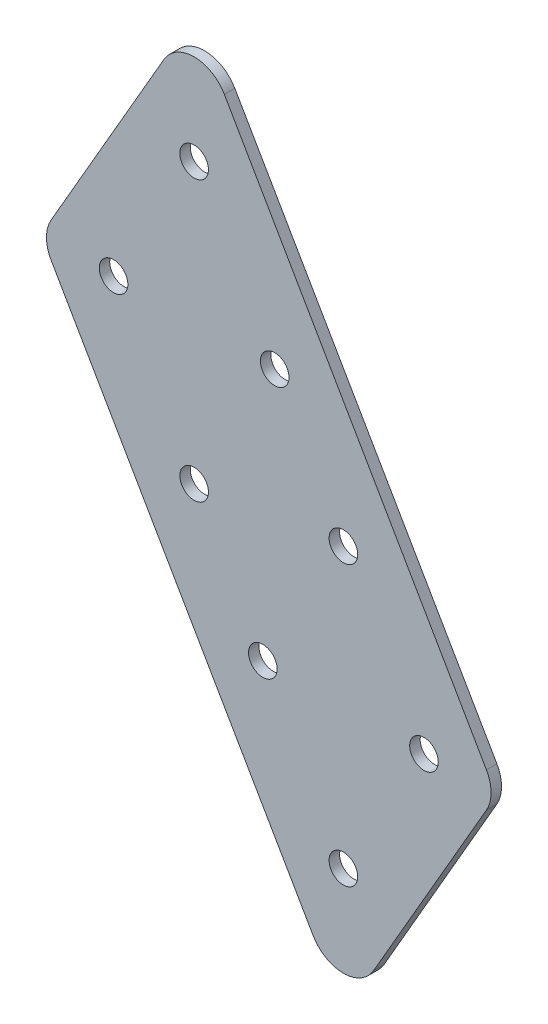
ISO-10303-21;
HEADER;
FILE_DESCRIPTION(('STEP AP214'),'2;1');
FILE_NAME('part.step','',(''),(''),'','','');
FILE_SCHEMA(('AUTOMOTIVE_DESIGN { 1 0 10303 214 1 1 1 1 }'));
ENDSEC;
DATA;
#1=APPLICATION_CONTEXT('core data for automotive mechanical design processes');
#2=APPLICATION_PROTOCOL_DEFINITION('international standard','automotive_design',2000,#1);
#3=PRODUCT_CONTEXT('',#1,'mechanical');
#4=PRODUCT('Part','Part','',(#3));
#5=PRODUCT_RELATED_PRODUCT_CATEGORY('part','',(#4));
#6=PRODUCT_DEFINITION_FORMATION('','',#4);
#7=PRODUCT_DEFINITION_CONTEXT('part definition',#1,'design');
#8=PRODUCT_DEFINITION('design','',#6,#7);
#9=PRODUCT_DEFINITION_SHAPE('','',#8);
#10=(LENGTH_UNIT() NAMED_UNIT(*) SI_UNIT(.MILLI.,.METRE.));
#11=(NAMED_UNIT(*) PLANE_ANGLE_UNIT() SI_UNIT($,.RADIAN.));
#12=(NAMED_UNIT(*) SI_UNIT($,.STERADIAN.) SOLID_ANGLE_UNIT());
#13=UNCERTAINTY_MEASURE_WITH_UNIT(LENGTH_MEASURE(1.E-05),#10,'distance_accuracy_value','');
#14=(GEOMETRIC_REPRESENTATION_CONTEXT(3) GLOBAL_UNCERTAINTY_ASSIGNED_CONTEXT((#13)) GLOBAL_UNIT_ASSIGNED_CONTEXT((#10,
#11,#12)) REPRESENTATION_CONTEXT('',''));
#15=CARTESIAN_POINT('',(0.,0.,0.));
#16=DIRECTION('',(0.,0.,1.));
#17=DIRECTION('',(1.,0.,0.));
#18=AXIS2_PLACEMENT_3D('',#15,#16,#17);
#19=CARTESIAN_POINT('',(234.319316648939,-517.331470202651,3.));
#20=DIRECTION('',(-0.866025403784435,-0.500000000000005,0.));
#21=DIRECTION('',(0.500000000000005,-0.866025403784435,0.));
#22=AXIS2_PLACEMENT_3D('',#19,#20,#21);
#23=PLANE('',#22);
#24=DIRECTION('',(-0.500000000000005,0.866025403784435,0.));
#25=VECTOR('',#24,1.);
#26=CARTESIAN_POINT('',(234.319316648939,-517.331470202651,3.));
#27=LINE('',#26,#25);
#28=CARTESIAN_POINT('',(26.2911804040921,-157.01616882272,3.));
#29=VERTEX_POINT('',#28);
#30=CARTESIAN_POINT('',(-48.8220896170173,-26.9161688235206,3.));
#31=VERTEX_POINT('',#30);
#32=EDGE_CURVE('E163',#29,#31,#27,.T.);
#33=ORIENTED_EDGE('',*,*,#32,.F.);
#34=DIRECTION('',(0.,0.,1.));
#35=VECTOR('',#34,1.);
#36=CARTESIAN_POINT('',(26.2911804040921,-157.01616882272,3.));
#37=LINE('',#36,#35);
#38=CARTESIAN_POINT('',(26.2911804040921,-157.01616882272,0.));
#39=VERTEX_POINT('',#38);
#40=EDGE_CURVE('E86',#29,#39,#37,.F.);
#41=ORIENTED_EDGE('',*,*,#40,.T.);
#42=DIRECTION('',(-0.500000000000005,0.866025403784435,0.));
#43=VECTOR('',#42,1.);
#44=CARTESIAN_POINT('',(234.319316648939,-517.331470202651,0.));
#45=LINE('',#44,#43);
#46=CARTESIAN_POINT('',(-48.8220896170173,-26.9161688235206,0.));
#47=VERTEX_POINT('',#46);
#48=EDGE_CURVE('E161',#39,#47,#45,.T.);
#49=ORIENTED_EDGE('',*,*,#48,.T.);
#50=DIRECTION('',(0.,0.,1.));
#51=VECTOR('',#50,1.);
#52=CARTESIAN_POINT('',(-48.8220896170173,-26.9161688235206,3.));
#53=LINE('',#52,#51);
#54=EDGE_CURVE('E91',#47,#31,#53,.T.);
#55=ORIENTED_EDGE('',*,*,#54,.T.);
#56=EDGE_LOOP('',(#33,#41,#49,#55));
#57=FACE_BOUND('',#56,.T.);
#58=ADVANCED_FACE('F16',(#57),#23,.F.);
#59=CARTESIAN_POINT('',(168.501385961322,-555.331470202652,3.));
#60=DIRECTION('',(0.866025403784435,0.500000000000005,0.));
#61=DIRECTION('',(-0.500000000000005,0.866025403784436,0.));
#62=AXIS2_PLACEMENT_3D('',#59,#60,#61);
#63=PLANE('',#62);
#64=DIRECTION('',(0.500000000000005,-0.866025403784436,0.));
#65=VECTOR('',#64,1.);
#66=CARTESIAN_POINT('',(168.501385961322,-555.331470202652,0.));
#67=LINE('',#66,#65);
#68=CARTESIAN_POINT('',(-98.4742127673251,-92.9161688235207,0.));
#69=VERTEX_POINT('',#68);
#70=CARTESIAN_POINT('',(-23.3609427462167,-223.016168822719,0.));
#71=VERTEX_POINT('',#70);
#72=EDGE_CURVE('E166',#69,#71,#67,.T.);
#73=ORIENTED_EDGE('',*,*,#72,.T.);
#74=DIRECTION('',(0.,0.,1.));
#75=VECTOR('',#74,1.);
#76=CARTESIAN_POINT('',(-23.3609427462167,-223.016168822719,3.));
#77=LINE('',#76,#75);
#78=CARTESIAN_POINT('',(-23.3609427462167,-223.016168822719,3.));
#79=VERTEX_POINT('',#78);
#80=EDGE_CURVE('E189',#71,#79,#77,.T.);
#81=ORIENTED_EDGE('',*,*,#80,.T.);
#82=DIRECTION('',(0.500000000000005,-0.866025403784436,0.));
#83=VECTOR('',#82,1.);
#84=CARTESIAN_POINT('',(168.501385961322,-555.331470202652,3.));
#85=LINE('',#84,#83);
#86=CARTESIAN_POINT('',(-98.4742127673251,-92.9161688235207,3.));
#87=VERTEX_POINT('',#86);
#88=EDGE_CURVE('E165',#87,#79,#85,.T.);
#89=ORIENTED_EDGE('',*,*,#88,.F.);
#90=DIRECTION('',(0.,0.,1.));
#91=VECTOR('',#90,1.);
#92=CARTESIAN_POINT('',(-98.4742127673251,-92.9161688235207,3.));
#93=LINE('',#92,#91);
#94=EDGE_CURVE('E187',#87,#69,#93,.F.);
#95=ORIENTED_EDGE('',*,*,#94,.T.);
#96=EDGE_LOOP('',(#73,#81,#89,#95));
#97=FACE_BOUND('',#96,.T.);
#98=ADVANCED_FACE('F210',(#97),#63,.F.);
#99=CARTESIAN_POINT('',(0.,0.,3.));
#100=DIRECTION('',(0.,0.,-1.));
#101=DIRECTION('',(-1.,0.,0.));
#102=AXIS2_PLACEMENT_3D('',#99,#100,#101);
#103=PLANE('',#102);
#104=CARTESIAN_POINT('',(-57.482343654861,-47.9161688235196,3.));
#105=DIRECTION('',(0.,0.,1.));
#106=DIRECTION('',(1.,0.,0.));
#107=AXIS2_PLACEMENT_3D('',#104,#105,#106);
#108=CIRCLE('',#107,4.1000000001539);
#109=CARTESIAN_POINT('',(-53.3823436547071,-47.9161688235196,3.));
#110=VERTEX_POINT('',#109);
#111=EDGE_CURVE('E115',#110,#110,#108,.T.);
#112=ORIENTED_EDGE('',*,*,#111,.F.);
#113=EDGE_LOOP('',(#112));
#114=FACE_BOUND('',#113,.T.);
#115=CARTESIAN_POINT('',(-34.3883328872759,-87.9161688235195,3.));
#116=DIRECTION('',(0.,0.,1.));
#117=DIRECTION('',(1.,0.,0.));
#118=AXIS2_PLACEMENT_3D('',#115,#116,#117);
#119=CIRCLE('',#118,4.10000000015386);
#120=CARTESIAN_POINT('',(-30.2883328871221,-87.9161688235195,3.));
#121=VERTEX_POINT('',#120);
#122=EDGE_CURVE('E121',#121,#121,#119,.T.);
#123=ORIENTED_EDGE('',*,*,#122,.F.);
#124=EDGE_LOOP('',(#123));
#125=FACE_BOUND('',#124,.T.);
#126=CARTESIAN_POINT('',(-80.576354422446,-87.9161688235195,3.));
#127=DIRECTION('',(0.,0.,1.));
#128=DIRECTION('',(1.,0.,0.));
#129=AXIS2_PLACEMENT_3D('',#126,#127,#128);
#130=CIRCLE('',#129,4.1000000001539);
#131=CARTESIAN_POINT('',(-76.4763544222921,-87.9161688235195,3.));
#132=VERTEX_POINT('',#131);
#133=EDGE_CURVE('E127',#132,#132,#130,.T.);
#134=ORIENTED_EDGE('',*,*,#133,.F.);
#135=EDGE_LOOP('',(#134));
#136=FACE_BOUND('',#135,.T.);
#137=CARTESIAN_POINT('',(-57.482343654861,-127.91616882352,3.));
#138=DIRECTION('',(0.,0.,1.));
#139=DIRECTION('',(1.,0.,0.));
#140=AXIS2_PLACEMENT_3D('',#137,#138,#139);
#141=CIRCLE('',#140,4.10000000015388);
#142=CARTESIAN_POINT('',(-53.3823436547071,-127.91616882352,3.));
#143=VERTEX_POINT('',#142);
#144=EDGE_CURVE('E133',#143,#143,#141,.T.);
#145=ORIENTED_EDGE('',*,*,#144,.F.);
#146=EDGE_LOOP('',(#145));
#147=FACE_BOUND('',#146,.T.);
#148=CARTESIAN_POINT('',(-14.7006887083719,-122.016168822719,3.));
#149=DIRECTION('',(0.,0.,1.));
#150=DIRECTION('',(1.,0.,0.));
#151=AXIS2_PLACEMENT_3D('',#148,#149,#150);
#152=CIRCLE('',#151,4.10000000015387);
#153=CARTESIAN_POINT('',(-10.600688708218,-122.016168822719,3.));
#154=VERTEX_POINT('',#153);
#155=EDGE_CURVE('E139',#154,#154,#152,.T.);
#156=ORIENTED_EDGE('',*,*,#155,.F.);
#157=EDGE_LOOP('',(#156));
#158=FACE_BOUND('',#157,.T.);
#159=CARTESIAN_POINT('',(8.39332205921314,-162.016168822719,3.));
#160=DIRECTION('',(0.,0.,1.));
#161=DIRECTION('',(1.,0.,0.));
#162=AXIS2_PLACEMENT_3D('',#159,#160,#161);
#163=CIRCLE('',#162,4.10000000015386);
#164=CARTESIAN_POINT('',(12.493322059367,-162.016168822719,3.));
#165=VERTEX_POINT('',#164);
#166=EDGE_CURVE('E145',#165,#165,#163,.T.);
#167=ORIENTED_EDGE('',*,*,#166,.F.);
#168=EDGE_LOOP('',(#167));
#169=FACE_BOUND('',#168,.T.);
#170=CARTESIAN_POINT('',(-37.7946994759569,-162.016168822719,3.));
#171=DIRECTION('',(0.,0.,1.));
#172=DIRECTION('',(1.,0.,0.));
#173=AXIS2_PLACEMENT_3D('',#170,#171,#172);
#174=CIRCLE('',#173,4.10000000015386);
#175=CARTESIAN_POINT('',(-33.694699475803,-162.016168822719,3.));
#176=VERTEX_POINT('',#175);
#177=EDGE_CURVE('E151',#176,#176,#174,.T.);
#178=ORIENTED_EDGE('',*,*,#177,.F.);
#179=EDGE_LOOP('',(#178));
#180=FACE_BOUND('',#179,.T.);
#181=CARTESIAN_POINT('',(-14.7006887083719,-202.016168822719,3.));
#182=DIRECTION('',(0.,0.,1.));
#183=DIRECTION('',(1.,0.,0.));
#184=AXIS2_PLACEMENT_3D('',#181,#182,#183);
#185=CIRCLE('',#184,4.10000000015385);
#186=CARTESIAN_POINT('',(-10.600688708218,-202.016168822719,3.));
#187=VERTEX_POINT('',#186);
#188=EDGE_CURVE('E108',#187,#187,#185,.T.);
#189=ORIENTED_EDGE('',*,*,#188,.F.);
#190=EDGE_LOOP('',(#189));
#191=FACE_BOUND('',#190,.T.);
#192=DIRECTION('',(-0.500000000000023,-0.866025403784426,0.));
#193=VECTOR('',#192,1.);
#194=CARTESIAN_POINT('',(-14.7006887083727,-238.016168822719,3.));
#195=LINE('',#194,#193);
#196=CARTESIAN_POINT('',(26.291180404092,-167.016168822721,3.));
#197=VERTEX_POINT('',#196);
#198=CARTESIAN_POINT('',(-6.04043467052805,-223.016168822719,3.));
#199=VERTEX_POINT('',#198);
#200=EDGE_CURVE('E98',#197,#199,#195,.T.);
#201=ORIENTED_EDGE('',*,*,#200,.F.);
#202=CARTESIAN_POINT('',(17.6309263662478,-162.01616882272,3.));
#203=DIRECTION('',(0.,0.,-1.));
#204=DIRECTION('',(-1.,0.,0.));
#205=AXIS2_PLACEMENT_3D('',#202,#203,#204);
#206=CIRCLE('',#205,10.);
#207=EDGE_CURVE('E81',#197,#29,#206,.F.);
#208=ORIENTED_EDGE('',*,*,#207,.T.);
#209=ORIENTED_EDGE('',*,*,#32,.T.);
#210=CARTESIAN_POINT('',(-57.4823436548616,-31.9161688235206,3.));
#211=DIRECTION('',(0.,0.,-1.));
#212=DIRECTION('',(-1.,0.,0.));
#213=AXIS2_PLACEMENT_3D('',#210,#211,#212);
#214=CIRCLE('',#213,10.);
#215=CARTESIAN_POINT('',(-66.1425976927061,-26.9161688235206,3.));
#216=VERTEX_POINT('',#215);
#217=EDGE_CURVE('E174',#31,#216,#214,.F.);
#218=ORIENTED_EDGE('',*,*,#217,.T.);
#219=DIRECTION('',(0.5,0.866025403784439,0.));
#220=VECTOR('',#219,1.);
#221=CARTESIAN_POINT('',(-57.4823436548613,-11.9161688235198,3.));
#222=LINE('',#221,#220);
#223=CARTESIAN_POINT('',(-98.4742127673252,-82.9161688235207,3.));
#224=VERTEX_POINT('',#223);
#225=EDGE_CURVE('E114',#224,#216,#222,.T.);
#226=ORIENTED_EDGE('',*,*,#225,.F.);
#227=CARTESIAN_POINT('',(-89.8139587294808,-87.9161688235207,3.));
#228=DIRECTION('',(0.,0.,-1.));
#229=DIRECTION('',(-1.,0.,0.));
#230=AXIS2_PLACEMENT_3D('',#227,#228,#229);
#231=CIRCLE('',#230,10.);
#232=EDGE_CURVE('E102',#224,#87,#231,.F.);
#233=ORIENTED_EDGE('',*,*,#232,.T.);
#234=ORIENTED_EDGE('',*,*,#88,.T.);
#235=CARTESIAN_POINT('',(-14.7006887083723,-218.016168822719,3.));
#236=DIRECTION('',(0.,0.,-1.));
#237=DIRECTION('',(-1.,0.,0.));
#238=AXIS2_PLACEMENT_3D('',#235,#236,#237);
#239=CIRCLE('',#238,10.);
#240=EDGE_CURVE('E92',#79,#199,#239,.F.);
#241=ORIENTED_EDGE('',*,*,#240,.T.);
#242=EDGE_LOOP('',(#201,#208,#209,#218,#226,#233,#234,#241));
#243=FACE_BOUND('',#242,.T.);
#244=ADVANCED_FACE('F105',(#114,#125,#136,#147,#158,#169,#180,#191,#243),#103,.F.);
#245=CARTESIAN_POINT('',(0.,0.,0.));
#246=DIRECTION('',(0.,0.,-1.));
#247=DIRECTION('',(-1.,0.,0.));
#248=AXIS2_PLACEMENT_3D('',#245,#246,#247);
#249=PLANE('',#248);
#250=ORIENTED_EDGE('',*,*,#48,.F.);
#251=CARTESIAN_POINT('',(17.6309263662478,-162.01616882272,0.));
#252=DIRECTION('',(0.,0.,-1.));
#253=DIRECTION('',(-1.,0.,0.));
#254=AXIS2_PLACEMENT_3D('',#251,#252,#253);
#255=CIRCLE('',#254,10.);
#256=CARTESIAN_POINT('',(26.291180404092,-167.016168822721,0.));
#257=VERTEX_POINT('',#256);
#258=EDGE_CURVE('E185',#39,#257,#255,.T.);
#259=ORIENTED_EDGE('',*,*,#258,.T.);
#260=DIRECTION('',(-0.500000000000023,-0.866025403784426,0.));
#261=VECTOR('',#260,1.);
#262=CARTESIAN_POINT('',(-14.7006887083727,-238.016168822719,0.));
#263=LINE('',#262,#261);
#264=CARTESIAN_POINT('',(-6.04043467052805,-223.016168822719,0.));
#265=VERTEX_POINT('',#264);
#266=EDGE_CURVE('E101',#257,#265,#263,.T.);
#267=ORIENTED_EDGE('',*,*,#266,.T.);
#268=CARTESIAN_POINT('',(-14.7006887083723,-218.016168822719,0.));
#269=DIRECTION('',(0.,0.,-1.));
#270=DIRECTION('',(-1.,0.,0.));
#271=AXIS2_PLACEMENT_3D('',#268,#269,#270);
#272=CIRCLE('',#271,10.);
#273=EDGE_CURVE('E183',#265,#71,#272,.T.);
#274=ORIENTED_EDGE('',*,*,#273,.T.);
#275=ORIENTED_EDGE('',*,*,#72,.F.);
#276=CARTESIAN_POINT('',(-89.8139587294808,-87.9161688235207,0.));
#277=DIRECTION('',(0.,0.,-1.));
#278=DIRECTION('',(-1.,0.,0.));
#279=AXIS2_PLACEMENT_3D('',#276,#277,#278);
#280=CIRCLE('',#279,10.);
#281=CARTESIAN_POINT('',(-98.4742127673252,-82.9161688235207,0.));
#282=VERTEX_POINT('',#281);
#283=EDGE_CURVE('E36',#69,#282,#280,.T.);
#284=ORIENTED_EDGE('',*,*,#283,.T.);
#285=DIRECTION('',(0.5,0.866025403784439,0.));
#286=VECTOR('',#285,1.);
#287=CARTESIAN_POINT('',(-57.4823436548613,-11.9161688235198,0.));
#288=LINE('',#287,#286);
#289=CARTESIAN_POINT('',(-66.1425976927061,-26.9161688235206,0.));
#290=VERTEX_POINT('',#289);
#291=EDGE_CURVE('E159',#282,#290,#288,.T.);
#292=ORIENTED_EDGE('',*,*,#291,.T.);
#293=CARTESIAN_POINT('',(-57.4823436548616,-31.9161688235206,0.));
#294=DIRECTION('',(0.,0.,-1.));
#295=DIRECTION('',(-1.,0.,0.));
#296=AXIS2_PLACEMENT_3D('',#293,#294,#295);
#297=CIRCLE('',#296,10.);
#298=EDGE_CURVE('E181',#290,#47,#297,.T.);
#299=ORIENTED_EDGE('',*,*,#298,.T.);
#300=EDGE_LOOP('',(#250,#259,#267,#274,#275,#284,#292,#299));
#301=FACE_BOUND('',#300,.T.);
#302=CARTESIAN_POINT('',(-57.482343654861,-47.9161688235196,0.));
#303=DIRECTION('',(0.,0.,1.));
#304=DIRECTION('',(1.,0.,0.));
#305=AXIS2_PLACEMENT_3D('',#302,#303,#304);
#306=CIRCLE('',#305,4.1000000001539);
#307=CARTESIAN_POINT('',(-53.3823436547071,-47.9161688235196,0.));
#308=VERTEX_POINT('',#307);
#309=EDGE_CURVE('E111',#308,#308,#306,.T.);
#310=ORIENTED_EDGE('',*,*,#309,.T.);
#311=EDGE_LOOP('',(#310));
#312=FACE_BOUND('',#311,.T.);
#313=CARTESIAN_POINT('',(-34.3883328872759,-87.9161688235195,0.));
#314=DIRECTION('',(0.,0.,1.));
#315=DIRECTION('',(1.,0.,0.));
#316=AXIS2_PLACEMENT_3D('',#313,#314,#315);
#317=CIRCLE('',#316,4.10000000015386);
#318=CARTESIAN_POINT('',(-30.2883328871221,-87.9161688235195,0.));
#319=VERTEX_POINT('',#318);
#320=EDGE_CURVE('E118',#319,#319,#317,.T.);
#321=ORIENTED_EDGE('',*,*,#320,.T.);
#322=EDGE_LOOP('',(#321));
#323=FACE_BOUND('',#322,.T.);
#324=CARTESIAN_POINT('',(-80.576354422446,-87.9161688235195,0.));
#325=DIRECTION('',(0.,0.,1.));
#326=DIRECTION('',(1.,0.,0.));
#327=AXIS2_PLACEMENT_3D('',#324,#325,#326);
#328=CIRCLE('',#327,4.1000000001539);
#329=CARTESIAN_POINT('',(-76.4763544222921,-87.9161688235195,0.));
#330=VERTEX_POINT('',#329);
#331=EDGE_CURVE('E124',#330,#330,#328,.T.);
#332=ORIENTED_EDGE('',*,*,#331,.T.);
#333=EDGE_LOOP('',(#332));
#334=FACE_BOUND('',#333,.T.);
#335=CARTESIAN_POINT('',(-57.482343654861,-127.91616882352,0.));
#336=DIRECTION('',(0.,0.,1.));
#337=DIRECTION('',(1.,0.,0.));
#338=AXIS2_PLACEMENT_3D('',#335,#336,#337);
#339=CIRCLE('',#338,4.10000000015388);
#340=CARTESIAN_POINT('',(-53.3823436547071,-127.91616882352,0.));
#341=VERTEX_POINT('',#340);
#342=EDGE_CURVE('E130',#341,#341,#339,.T.);
#343=ORIENTED_EDGE('',*,*,#342,.T.);
#344=EDGE_LOOP('',(#343));
#345=FACE_BOUND('',#344,.T.);
#346=CARTESIAN_POINT('',(-14.7006887083719,-122.016168822719,0.));
#347=DIRECTION('',(0.,0.,1.));
#348=DIRECTION('',(1.,0.,0.));
#349=AXIS2_PLACEMENT_3D('',#346,#347,#348);
#350=CIRCLE('',#349,4.10000000015387);
#351=CARTESIAN_POINT('',(-10.600688708218,-122.016168822719,0.));
#352=VERTEX_POINT('',#351);
#353=EDGE_CURVE('E136',#352,#352,#350,.T.);
#354=ORIENTED_EDGE('',*,*,#353,.T.);
#355=EDGE_LOOP('',(#354));
#356=FACE_BOUND('',#355,.T.);
#357=CARTESIAN_POINT('',(8.39332205921314,-162.016168822719,0.));
#358=DIRECTION('',(0.,0.,1.));
#359=DIRECTION('',(1.,0.,0.));
#360=AXIS2_PLACEMENT_3D('',#357,#358,#359);
#361=CIRCLE('',#360,4.10000000015386);
#362=CARTESIAN_POINT('',(12.493322059367,-162.016168822719,0.));
#363=VERTEX_POINT('',#362);
#364=EDGE_CURVE('E142',#363,#363,#361,.T.);
#365=ORIENTED_EDGE('',*,*,#364,.T.);
#366=EDGE_LOOP('',(#365));
#367=FACE_BOUND('',#366,.T.);
#368=CARTESIAN_POINT('',(-37.7946994759569,-162.016168822719,0.));
#369=DIRECTION('',(0.,0.,1.));
#370=DIRECTION('',(1.,0.,0.));
#371=AXIS2_PLACEMENT_3D('',#368,#369,#370);
#372=CIRCLE('',#371,4.10000000015386);
#373=CARTESIAN_POINT('',(-33.694699475803,-162.016168822719,0.));
#374=VERTEX_POINT('',#373);
#375=EDGE_CURVE('E148',#374,#374,#372,.T.);
#376=ORIENTED_EDGE('',*,*,#375,.T.);
#377=EDGE_LOOP('',(#376));
#378=FACE_BOUND('',#377,.T.);
#379=CARTESIAN_POINT('',(-14.7006887083719,-202.016168822719,0.));
#380=DIRECTION('',(0.,0.,1.));
#381=DIRECTION('',(1.,0.,0.));
#382=AXIS2_PLACEMENT_3D('',#379,#380,#381);
#383=CIRCLE('',#382,4.10000000015385);
#384=CARTESIAN_POINT('',(-10.600688708218,-202.016168822719,0.));
#385=VERTEX_POINT('',#384);
#386=EDGE_CURVE('E154',#385,#385,#383,.T.);
#387=ORIENTED_EDGE('',*,*,#386,.T.);
#388=EDGE_LOOP('',(#387));
#389=FACE_BOUND('',#388,.T.);
#390=ADVANCED_FACE('F203',(#301,#312,#323,#334,#345,#356,#367,#378,#389),#249,.T.);
#391=CARTESIAN_POINT('',(-57.4823436548613,-11.9161688235198,0.));
#392=DIRECTION('',(0.866025403784439,-0.5,0.));
#393=DIRECTION('',(0.5,0.866025403784439,0.));
#394=AXIS2_PLACEMENT_3D('',#391,#392,#393);
#395=PLANE('',#394);
#396=ORIENTED_EDGE('',*,*,#225,.T.);
#397=DIRECTION('',(0.,0.,1.));
#398=VECTOR('',#397,1.);
#399=CARTESIAN_POINT('',(-66.1425976927061,-26.9161688235206,0.));
#400=LINE('',#399,#398);
#401=EDGE_CURVE('E10',#216,#290,#400,.F.);
#402=ORIENTED_EDGE('',*,*,#401,.T.);
#403=ORIENTED_EDGE('',*,*,#291,.F.);
#404=DIRECTION('',(0.,0.,1.));
#405=VECTOR('',#404,1.);
#406=CARTESIAN_POINT('',(-98.4742127673252,-82.9161688235207,0.));
#407=LINE('',#406,#405);
#408=EDGE_CURVE('E24',#282,#224,#407,.T.);
#409=ORIENTED_EDGE('',*,*,#408,.T.);
#410=EDGE_LOOP('',(#396,#402,#403,#409));
#411=FACE_BOUND('',#410,.T.);
#412=ADVANCED_FACE('F194',(#411),#395,.F.);
#413=CARTESIAN_POINT('',(-14.7006887083719,-202.016168822719,0.));
#414=DIRECTION('',(0.,0.,1.));
#415=DIRECTION('',(1.,0.,0.));
#416=AXIS2_PLACEMENT_3D('',#413,#414,#415);
#417=CYLINDRICAL_SURFACE('',#416,4.10000000015385);
#418=ORIENTED_EDGE('',*,*,#386,.F.);
#419=EDGE_LOOP('',(#418));
#420=FACE_BOUND('',#419,.T.);
#421=ORIENTED_EDGE('',*,*,#188,.T.);
#422=EDGE_LOOP('',(#421));
#423=FACE_BOUND('',#422,.T.);
#424=ADVANCED_FACE('F334',(#420,#423),#417,.F.);
#425=CARTESIAN_POINT('',(-37.7946994759569,-162.016168822719,0.));
#426=DIRECTION('',(0.,0.,1.));
#427=DIRECTION('',(1.,0.,0.));
#428=AXIS2_PLACEMENT_3D('',#425,#426,#427);
#429=CYLINDRICAL_SURFACE('',#428,4.10000000015386);
#430=ORIENTED_EDGE('',*,*,#375,.F.);
#431=EDGE_LOOP('',(#430));
#432=FACE_BOUND('',#431,.T.);
#433=ORIENTED_EDGE('',*,*,#177,.T.);
#434=EDGE_LOOP('',(#433));
#435=FACE_BOUND('',#434,.T.);
#436=ADVANCED_FACE('F325',(#432,#435),#429,.F.);
#437=CARTESIAN_POINT('',(8.39332205921314,-162.016168822719,0.));
#438=DIRECTION('',(0.,0.,1.));
#439=DIRECTION('',(1.,0.,0.));
#440=AXIS2_PLACEMENT_3D('',#437,#438,#439);
#441=CYLINDRICAL_SURFACE('',#440,4.10000000015386);
#442=ORIENTED_EDGE('',*,*,#364,.F.);
#443=EDGE_LOOP('',(#442));
#444=FACE_BOUND('',#443,.T.);
#445=ORIENTED_EDGE('',*,*,#166,.T.);
#446=EDGE_LOOP('',(#445));
#447=FACE_BOUND('',#446,.T.);
#448=ADVANCED_FACE('F316',(#444,#447),#441,.F.);
#449=CARTESIAN_POINT('',(-14.7006887083719,-122.016168822719,0.));
#450=DIRECTION('',(0.,0.,1.));
#451=DIRECTION('',(1.,0.,0.));
#452=AXIS2_PLACEMENT_3D('',#449,#450,#451);
#453=CYLINDRICAL_SURFACE('',#452,4.10000000015387);
#454=ORIENTED_EDGE('',*,*,#353,.F.);
#455=EDGE_LOOP('',(#454));
#456=FACE_BOUND('',#455,.T.);
#457=ORIENTED_EDGE('',*,*,#155,.T.);
#458=EDGE_LOOP('',(#457));
#459=FACE_BOUND('',#458,.T.);
#460=ADVANCED_FACE('F307',(#456,#459),#453,.F.);
#461=CARTESIAN_POINT('',(-57.482343654861,-127.91616882352,0.));
#462=DIRECTION('',(0.,0.,1.));
#463=DIRECTION('',(1.,0.,0.));
#464=AXIS2_PLACEMENT_3D('',#461,#462,#463);
#465=CYLINDRICAL_SURFACE('',#464,4.10000000015388);
#466=ORIENTED_EDGE('',*,*,#342,.F.);
#467=EDGE_LOOP('',(#466));
#468=FACE_BOUND('',#467,.T.);
#469=ORIENTED_EDGE('',*,*,#144,.T.);
#470=EDGE_LOOP('',(#469));
#471=FACE_BOUND('',#470,.T.);
#472=ADVANCED_FACE('F298',(#468,#471),#465,.F.);
#473=CARTESIAN_POINT('',(-80.576354422446,-87.9161688235195,0.));
#474=DIRECTION('',(0.,0.,1.));
#475=DIRECTION('',(1.,0.,0.));
#476=AXIS2_PLACEMENT_3D('',#473,#474,#475);
#477=CYLINDRICAL_SURFACE('',#476,4.1000000001539);
#478=ORIENTED_EDGE('',*,*,#331,.F.);
#479=EDGE_LOOP('',(#478));
#480=FACE_BOUND('',#479,.T.);
#481=ORIENTED_EDGE('',*,*,#133,.T.);
#482=EDGE_LOOP('',(#481));
#483=FACE_BOUND('',#482,.T.);
#484=ADVANCED_FACE('F289',(#480,#483),#477,.F.);
#485=CARTESIAN_POINT('',(-34.3883328872759,-87.9161688235195,0.));
#486=DIRECTION('',(0.,0.,1.));
#487=DIRECTION('',(1.,0.,0.));
#488=AXIS2_PLACEMENT_3D('',#485,#486,#487);
#489=CYLINDRICAL_SURFACE('',#488,4.10000000015386);
#490=ORIENTED_EDGE('',*,*,#320,.F.);
#491=EDGE_LOOP('',(#490));
#492=FACE_BOUND('',#491,.T.);
#493=ORIENTED_EDGE('',*,*,#122,.T.);
#494=EDGE_LOOP('',(#493));
#495=FACE_BOUND('',#494,.T.);
#496=ADVANCED_FACE('F280',(#492,#495),#489,.F.);
#497=CARTESIAN_POINT('',(-57.482343654861,-47.9161688235196,0.));
#498=DIRECTION('',(0.,0.,1.));
#499=DIRECTION('',(1.,0.,0.));
#500=AXIS2_PLACEMENT_3D('',#497,#498,#499);
#501=CYLINDRICAL_SURFACE('',#500,4.1000000001539);
#502=ORIENTED_EDGE('',*,*,#309,.F.);
#503=EDGE_LOOP('',(#502));
#504=FACE_BOUND('',#503,.T.);
#505=ORIENTED_EDGE('',*,*,#111,.T.);
#506=EDGE_LOOP('',(#505));
#507=FACE_BOUND('',#506,.T.);
#508=ADVANCED_FACE('F272',(#504,#507),#501,.F.);
#509=CARTESIAN_POINT('',(-14.7006887083727,-238.016168822719,0.));
#510=DIRECTION('',(-0.866025403784426,0.500000000000023,0.));
#511=DIRECTION('',(-0.500000000000023,-0.866025403784426,0.));
#512=AXIS2_PLACEMENT_3D('',#509,#510,#511);
#513=PLANE('',#512);
#514=ORIENTED_EDGE('',*,*,#266,.F.);
#515=DIRECTION('',(0.,0.,1.));
#516=VECTOR('',#515,1.);
#517=CARTESIAN_POINT('',(26.2911804040921,-167.016168822721,0.));
#518=LINE('',#517,#516);
#519=EDGE_CURVE('E85',#257,#197,#518,.T.);
#520=ORIENTED_EDGE('',*,*,#519,.T.);
#521=ORIENTED_EDGE('',*,*,#200,.T.);
#522=DIRECTION('',(0.,0.,1.));
#523=VECTOR('',#522,1.);
#524=CARTESIAN_POINT('',(-6.04043467052804,-223.016168822719,0.));
#525=LINE('',#524,#523);
#526=EDGE_CURVE('E103',#199,#265,#525,.F.);
#527=ORIENTED_EDGE('',*,*,#526,.T.);
#528=EDGE_LOOP('',(#514,#520,#521,#527));
#529=FACE_BOUND('',#528,.T.);
#530=ADVANCED_FACE('F97',(#529),#513,.F.);
#531=CARTESIAN_POINT('',(17.6309263662478,-162.01616882272,0.));
#532=DIRECTION('',(0.,0.,1.));
#533=DIRECTION('',(1.,0.,0.));
#534=AXIS2_PLACEMENT_3D('',#531,#532,#533);
#535=CYLINDRICAL_SURFACE('',#534,10.);
#536=ORIENTED_EDGE('',*,*,#258,.F.);
#537=ORIENTED_EDGE('',*,*,#40,.F.);
#538=ORIENTED_EDGE('',*,*,#207,.F.);
#539=ORIENTED_EDGE('',*,*,#519,.F.);
#540=EDGE_LOOP('',(#536,#537,#538,#539));
#541=FACE_BOUND('',#540,.T.);
#542=ADVANCED_FACE('F84',(#541),#535,.T.);
#543=CARTESIAN_POINT('',(-14.7006887083723,-218.016168822719,3.));
#544=DIRECTION('',(0.,0.,1.));
#545=DIRECTION('',(1.,0.,0.));
#546=AXIS2_PLACEMENT_3D('',#543,#544,#545);
#547=CYLINDRICAL_SURFACE('',#546,10.);
#548=ORIENTED_EDGE('',*,*,#273,.F.);
#549=ORIENTED_EDGE('',*,*,#526,.F.);
#550=ORIENTED_EDGE('',*,*,#240,.F.);
#551=ORIENTED_EDGE('',*,*,#80,.F.);
#552=EDGE_LOOP('',(#548,#549,#550,#551));
#553=FACE_BOUND('',#552,.T.);
#554=ADVANCED_FACE('F208',(#553),#547,.T.);
#555=CARTESIAN_POINT('',(-57.4823436548616,-31.9161688235206,3.));
#556=DIRECTION('',(0.,0.,1.));
#557=DIRECTION('',(1.,0.,0.));
#558=AXIS2_PLACEMENT_3D('',#555,#556,#557);
#559=CYLINDRICAL_SURFACE('',#558,10.);
#560=ORIENTED_EDGE('',*,*,#298,.F.);
#561=ORIENTED_EDGE('',*,*,#401,.F.);
#562=ORIENTED_EDGE('',*,*,#217,.F.);
#563=ORIENTED_EDGE('',*,*,#54,.F.);
#564=EDGE_LOOP('',(#560,#561,#562,#563));
#565=FACE_BOUND('',#564,.T.);
#566=ADVANCED_FACE('F200',(#565),#559,.T.);
#567=CARTESIAN_POINT('',(-89.8139587294808,-87.9161688235207,0.));
#568=DIRECTION('',(0.,0.,1.));
#569=DIRECTION('',(1.,0.,0.));
#570=AXIS2_PLACEMENT_3D('',#567,#568,#569);
#571=CYLINDRICAL_SURFACE('',#570,10.);
#572=ORIENTED_EDGE('',*,*,#283,.F.);
#573=ORIENTED_EDGE('',*,*,#94,.F.);
#574=ORIENTED_EDGE('',*,*,#232,.F.);
#575=ORIENTED_EDGE('',*,*,#408,.F.);
#576=EDGE_LOOP('',(#572,#573,#574,#575));
#577=FACE_BOUND('',#576,.T.);
#578=ADVANCED_FACE('F18',(#577),#571,.T.);
#579=CLOSED_SHELL('',(#58,#98,#244,#390,#412,#424,#436,#448,#460,#472,#484,#496,#508,#530,#542,
#554,#566,#578));
#580=MANIFOLD_SOLID_BREP('B1',#579);
#581=ADVANCED_BREP_SHAPE_REPRESENTATION('',(#18,#580),#14);
#582=SHAPE_DEFINITION_REPRESENTATION(#9,#581);
ENDSEC;
END-ISO-10303-21;
